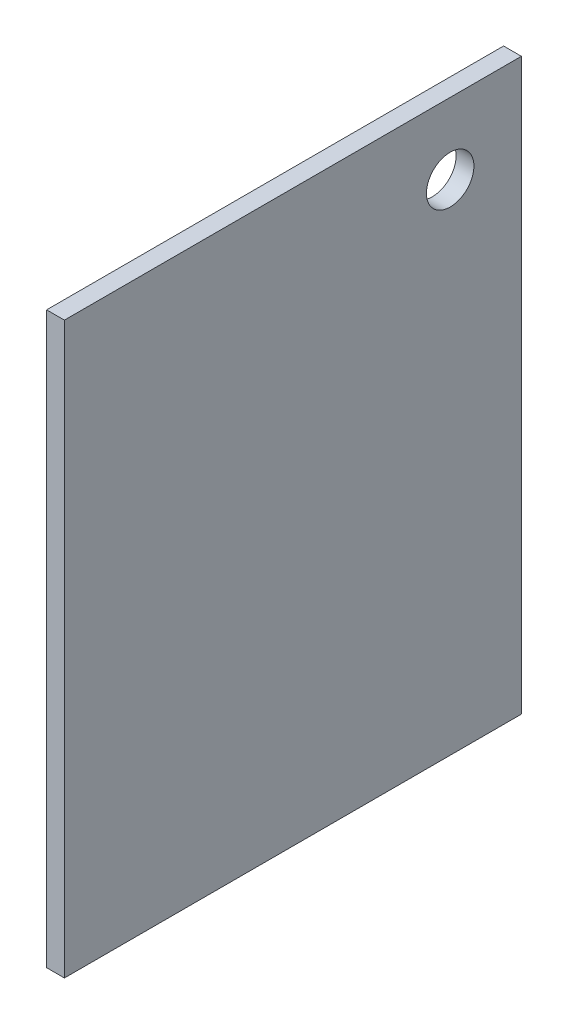
ISO-10303-21;
HEADER;
FILE_DESCRIPTION(('STEP AP214'),'2;1');
FILE_NAME('part.step','',(''),(''),'','','');
FILE_SCHEMA(('AUTOMOTIVE_DESIGN { 1 0 10303 214 1 1 1 1 }'));
ENDSEC;
DATA;
#1=APPLICATION_CONTEXT('core data for automotive mechanical design processes');
#2=APPLICATION_PROTOCOL_DEFINITION('international standard','automotive_design',2000,#1);
#3=PRODUCT_CONTEXT('',#1,'mechanical');
#4=PRODUCT('Part','Part','',(#3));
#5=PRODUCT_RELATED_PRODUCT_CATEGORY('part','',(#4));
#6=PRODUCT_DEFINITION_FORMATION('','',#4);
#7=PRODUCT_DEFINITION_CONTEXT('part definition',#1,'design');
#8=PRODUCT_DEFINITION('design','',#6,#7);
#9=PRODUCT_DEFINITION_SHAPE('','',#8);
#10=(LENGTH_UNIT() NAMED_UNIT(*) SI_UNIT(.MILLI.,.METRE.));
#11=(NAMED_UNIT(*) PLANE_ANGLE_UNIT() SI_UNIT($,.RADIAN.));
#12=(NAMED_UNIT(*) SI_UNIT($,.STERADIAN.) SOLID_ANGLE_UNIT());
#13=UNCERTAINTY_MEASURE_WITH_UNIT(LENGTH_MEASURE(1.E-05),#10,'distance_accuracy_value','');
#14=(GEOMETRIC_REPRESENTATION_CONTEXT(3) GLOBAL_UNCERTAINTY_ASSIGNED_CONTEXT((#13)) GLOBAL_UNIT_ASSIGNED_CONTEXT((#10,
#11,#12)) REPRESENTATION_CONTEXT('',''));
#15=CARTESIAN_POINT('',(0.,0.,0.));
#16=DIRECTION('',(0.,0.,1.));
#17=DIRECTION('',(1.,0.,0.));
#18=AXIS2_PLACEMENT_3D('',#15,#16,#17);
#19=CARTESIAN_POINT('',(-527.05,590.55,-244.475));
#20=DIRECTION('',(0.,-1.,0.));
#21=DIRECTION('',(0.,0.,-1.));
#22=AXIS2_PLACEMENT_3D('',#19,#20,#21);
#23=PLANE('',#22);
#24=DIRECTION('',(0.,0.,-1.));
#25=VECTOR('',#24,1.);
#26=CARTESIAN_POINT('',(-508.,590.55,-244.475));
#27=LINE('',#26,#25);
#28=CARTESIAN_POINT('',(-508.,590.55,244.475));
#29=VERTEX_POINT('',#28);
#30=CARTESIAN_POINT('',(-508.,590.55,-244.475));
#31=VERTEX_POINT('',#30);
#32=EDGE_CURVE('E102',#29,#31,#27,.T.);
#33=ORIENTED_EDGE('',*,*,#32,.T.);
#34=DIRECTION('',(1.,0.,0.));
#35=VECTOR('',#34,1.);
#36=CARTESIAN_POINT('',(-527.05,590.55,-244.475));
#37=LINE('',#36,#35);
#38=CARTESIAN_POINT('',(-527.05,590.55,-244.475));
#39=VERTEX_POINT('',#38);
#40=EDGE_CURVE('E11',#39,#31,#37,.T.);
#41=ORIENTED_EDGE('',*,*,#40,.F.);
#42=DIRECTION('',(0.,0.,-1.));
#43=VECTOR('',#42,1.);
#44=CARTESIAN_POINT('',(-527.05,590.55,-244.475));
#45=LINE('',#44,#43);
#46=CARTESIAN_POINT('',(-527.05,590.55,244.475));
#47=VERTEX_POINT('',#46);
#48=EDGE_CURVE('E90',#47,#39,#45,.T.);
#49=ORIENTED_EDGE('',*,*,#48,.F.);
#50=DIRECTION('',(1.,0.,0.));
#51=VECTOR('',#50,1.);
#52=CARTESIAN_POINT('',(-527.05,590.55,244.475));
#53=LINE('',#52,#51);
#54=EDGE_CURVE('E98',#47,#29,#53,.T.);
#55=ORIENTED_EDGE('',*,*,#54,.T.);
#56=EDGE_LOOP('',(#33,#41,#49,#55));
#57=FACE_BOUND('',#56,.T.);
#58=ADVANCED_FACE('F39',(#57),#23,.F.);
#59=CARTESIAN_POINT('',(-527.05,590.55,-244.475));
#60=DIRECTION('',(0.,0.,1.));
#61=DIRECTION('',(0.,-1.,0.));
#62=AXIS2_PLACEMENT_3D('',#59,#60,#61);
#63=PLANE('',#62);
#64=DIRECTION('',(0.,-1.,0.));
#65=VECTOR('',#64,1.);
#66=CARTESIAN_POINT('',(-508.,590.55,-244.475));
#67=LINE('',#66,#65);
#68=CARTESIAN_POINT('',(-508.,-19.05,-244.475));
#69=VERTEX_POINT('',#68);
#70=EDGE_CURVE('E94',#31,#69,#67,.T.);
#71=ORIENTED_EDGE('',*,*,#70,.T.);
#72=DIRECTION('',(1.,0.,0.));
#73=VECTOR('',#72,1.);
#74=CARTESIAN_POINT('',(-527.05,-19.05,-244.475));
#75=LINE('',#74,#73);
#76=CARTESIAN_POINT('',(-527.05,-19.05,-244.475));
#77=VERTEX_POINT('',#76);
#78=EDGE_CURVE('E47',#77,#69,#75,.T.);
#79=ORIENTED_EDGE('',*,*,#78,.F.);
#80=DIRECTION('',(0.,-1.,0.));
#81=VECTOR('',#80,1.);
#82=CARTESIAN_POINT('',(-527.05,590.55,-244.475));
#83=LINE('',#82,#81);
#84=EDGE_CURVE('E85',#39,#77,#83,.T.);
#85=ORIENTED_EDGE('',*,*,#84,.F.);
#86=ORIENTED_EDGE('',*,*,#40,.T.);
#87=EDGE_LOOP('',(#71,#79,#85,#86));
#88=FACE_BOUND('',#87,.T.);
#89=ADVANCED_FACE('F93',(#88),#63,.F.);
#90=CARTESIAN_POINT('',(-527.05,-19.05,-244.475));
#91=DIRECTION('',(0.,1.,0.));
#92=DIRECTION('',(0.,0.,1.));
#93=AXIS2_PLACEMENT_3D('',#90,#91,#92);
#94=PLANE('',#93);
#95=DIRECTION('',(0.,0.,1.));
#96=VECTOR('',#95,1.);
#97=CARTESIAN_POINT('',(-508.,-19.05,-244.475));
#98=LINE('',#97,#96);
#99=CARTESIAN_POINT('',(-508.,-19.05,244.475));
#100=VERTEX_POINT('',#99);
#101=EDGE_CURVE('E72',#69,#100,#98,.T.);
#102=ORIENTED_EDGE('',*,*,#101,.T.);
#103=DIRECTION('',(1.,0.,0.));
#104=VECTOR('',#103,1.);
#105=CARTESIAN_POINT('',(-527.05,-19.05,244.475));
#106=LINE('',#105,#104);
#107=CARTESIAN_POINT('',(-527.05,-19.05,244.475));
#108=VERTEX_POINT('',#107);
#109=EDGE_CURVE('E95',#108,#100,#106,.T.);
#110=ORIENTED_EDGE('',*,*,#109,.F.);
#111=DIRECTION('',(0.,0.,1.));
#112=VECTOR('',#111,1.);
#113=CARTESIAN_POINT('',(-527.05,-19.05,-244.475));
#114=LINE('',#113,#112);
#115=EDGE_CURVE('E88',#77,#108,#114,.T.);
#116=ORIENTED_EDGE('',*,*,#115,.F.);
#117=ORIENTED_EDGE('',*,*,#78,.T.);
#118=EDGE_LOOP('',(#102,#110,#116,#117));
#119=FACE_BOUND('',#118,.T.);
#120=ADVANCED_FACE('F96',(#119),#94,.F.);
#121=CARTESIAN_POINT('',(-527.05,590.55,244.475));
#122=DIRECTION('',(0.,0.,-1.));
#123=DIRECTION('',(0.,1.,0.));
#124=AXIS2_PLACEMENT_3D('',#121,#122,#123);
#125=PLANE('',#124);
#126=DIRECTION('',(0.,1.,0.));
#127=VECTOR('',#126,1.);
#128=CARTESIAN_POINT('',(-508.,590.55,244.475));
#129=LINE('',#128,#127);
#130=EDGE_CURVE('E78',#100,#29,#129,.T.);
#131=ORIENTED_EDGE('',*,*,#130,.T.);
#132=ORIENTED_EDGE('',*,*,#54,.F.);
#133=DIRECTION('',(0.,1.,0.));
#134=VECTOR('',#133,1.);
#135=CARTESIAN_POINT('',(-527.05,590.55,244.475));
#136=LINE('',#135,#134);
#137=EDGE_CURVE('E55',#108,#47,#136,.T.);
#138=ORIENTED_EDGE('',*,*,#137,.F.);
#139=ORIENTED_EDGE('',*,*,#109,.T.);
#140=EDGE_LOOP('',(#131,#132,#138,#139));
#141=FACE_BOUND('',#140,.T.);
#142=ADVANCED_FACE('F110',(#141),#125,.F.);
#143=CARTESIAN_POINT('',(-527.05,0.,0.));
#144=DIRECTION('',(1.,0.,0.));
#145=DIRECTION('',(0.,0.,-1.));
#146=AXIS2_PLACEMENT_3D('',#143,#144,#145);
#147=PLANE('',#146);
#148=CARTESIAN_POINT('',(-527.05,514.35,-168.275));
#149=DIRECTION('',(1.,0.,0.));
#150=DIRECTION('',(0.,0.,-1.));
#151=AXIS2_PLACEMENT_3D('',#148,#149,#150);
#152=CIRCLE('',#151,25.4);
#153=CARTESIAN_POINT('',(-527.05,514.35,-193.675));
#154=VERTEX_POINT('',#153);
#155=EDGE_CURVE('E105',#154,#154,#152,.F.);
#156=ORIENTED_EDGE('',*,*,#155,.F.);
#157=EDGE_LOOP('',(#156));
#158=FACE_BOUND('',#157,.T.);
#159=ORIENTED_EDGE('',*,*,#48,.T.);
#160=ORIENTED_EDGE('',*,*,#84,.T.);
#161=ORIENTED_EDGE('',*,*,#115,.T.);
#162=ORIENTED_EDGE('',*,*,#137,.T.);
#163=EDGE_LOOP('',(#159,#160,#161,#162));
#164=FACE_BOUND('',#163,.T.);
#165=ADVANCED_FACE('F86',(#158,#164),#147,.F.);
#166=CARTESIAN_POINT('',(-508.,0.,0.));
#167=DIRECTION('',(1.,0.,0.));
#168=DIRECTION('',(0.,0.,-1.));
#169=AXIS2_PLACEMENT_3D('',#166,#167,#168);
#170=PLANE('',#169);
#171=CARTESIAN_POINT('',(-508.,514.35,-168.275));
#172=DIRECTION('',(1.,0.,0.));
#173=DIRECTION('',(0.,0.,-1.));
#174=AXIS2_PLACEMENT_3D('',#171,#172,#173);
#175=CIRCLE('',#174,25.4);
#176=CARTESIAN_POINT('',(-508.,514.35,-193.675));
#177=VERTEX_POINT('',#176);
#178=EDGE_CURVE('E118',#177,#177,#175,.T.);
#179=ORIENTED_EDGE('',*,*,#178,.F.);
#180=EDGE_LOOP('',(#179));
#181=FACE_BOUND('',#180,.T.);
#182=ORIENTED_EDGE('',*,*,#32,.F.);
#183=ORIENTED_EDGE('',*,*,#130,.F.);
#184=ORIENTED_EDGE('',*,*,#101,.F.);
#185=ORIENTED_EDGE('',*,*,#70,.F.);
#186=EDGE_LOOP('',(#182,#183,#184,#185));
#187=FACE_BOUND('',#186,.T.);
#188=ADVANCED_FACE('F113',(#181,#187),#170,.T.);
#189=CARTESIAN_POINT('',(-598.892048968553,514.35,-168.275));
#190=DIRECTION('',(1.,0.,0.));
#191=DIRECTION('',(0.,0.,-1.));
#192=AXIS2_PLACEMENT_3D('',#189,#190,#191);
#193=CYLINDRICAL_SURFACE('',#192,25.4);
#194=ORIENTED_EDGE('',*,*,#155,.T.);
#195=EDGE_LOOP('',(#194));
#196=FACE_BOUND('',#195,.T.);
#197=ORIENTED_EDGE('',*,*,#178,.T.);
#198=EDGE_LOOP('',(#197));
#199=FACE_BOUND('',#198,.T.);
#200=ADVANCED_FACE('F122',(#196,#199),#193,.F.);
#201=CLOSED_SHELL('',(#58,#89,#120,#142,#165,#188,#200));
#202=MANIFOLD_SOLID_BREP('B2',#201);
#203=ADVANCED_BREP_SHAPE_REPRESENTATION('',(#18,#202),#14);
#204=SHAPE_DEFINITION_REPRESENTATION(#9,#203);
ENDSEC;
END-ISO-10303-21;
